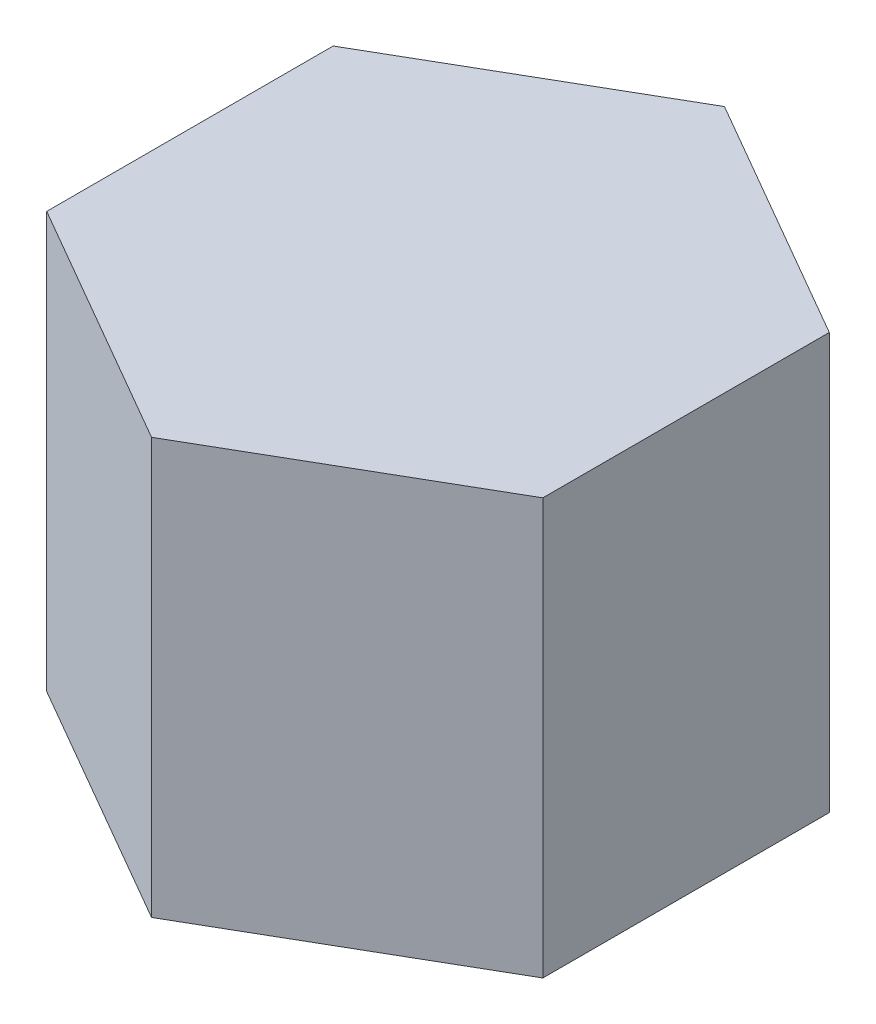
ISO-10303-21;
HEADER;
FILE_DESCRIPTION(('STEP AP214'),'2;1');
FILE_NAME('part.step','',(''),(''),'','','');
FILE_SCHEMA(('AUTOMOTIVE_DESIGN { 1 0 10303 214 1 1 1 1 }'));
ENDSEC;
DATA;
#1=APPLICATION_CONTEXT('core data for automotive mechanical design processes');
#2=APPLICATION_PROTOCOL_DEFINITION('international standard','automotive_design',2000,#1);
#3=PRODUCT_CONTEXT('',#1,'mechanical');
#4=PRODUCT('Part','Part','',(#3));
#5=PRODUCT_RELATED_PRODUCT_CATEGORY('part','',(#4));
#6=PRODUCT_DEFINITION_FORMATION('','',#4);
#7=PRODUCT_DEFINITION_CONTEXT('part definition',#1,'design');
#8=PRODUCT_DEFINITION('design','',#6,#7);
#9=PRODUCT_DEFINITION_SHAPE('','',#8);
#10=(LENGTH_UNIT() NAMED_UNIT(*) SI_UNIT(.MILLI.,.METRE.));
#11=(NAMED_UNIT(*) PLANE_ANGLE_UNIT() SI_UNIT($,.RADIAN.));
#12=(NAMED_UNIT(*) SI_UNIT($,.STERADIAN.) SOLID_ANGLE_UNIT());
#13=UNCERTAINTY_MEASURE_WITH_UNIT(LENGTH_MEASURE(1.E-05),#10,'distance_accuracy_value','');
#14=(GEOMETRIC_REPRESENTATION_CONTEXT(3) GLOBAL_UNCERTAINTY_ASSIGNED_CONTEXT((#13)) GLOBAL_UNIT_ASSIGNED_CONTEXT((#10,
#11,#12)) REPRESENTATION_CONTEXT('',''));
#15=CARTESIAN_POINT('',(0.,0.,0.));
#16=DIRECTION('',(0.,0.,1.));
#17=DIRECTION('',(1.,0.,0.));
#18=AXIS2_PLACEMENT_3D('',#15,#16,#17);
#19=CARTESIAN_POINT('',(206.142660308706,-148.537700895744,290.64094581671));
#20=DIRECTION('',(-0.499999999999909,0.,-0.866025403784491));
#21=DIRECTION('',(-0.866025403784491,0.,0.499999999999909));
#22=AXIS2_PLACEMENT_3D('',#19,#20,#21);
#23=PLANE('',#22);
#24=CARTESIAN_POINT('',(205.839551417382,-149.045793579175,290.81594581671));
#25=DIRECTION('',(0.866025403784491,0.,-0.499999999999909));
#26=VECTOR('',#25,1.);
#27=LINE('',#24,#26);
#28=CARTESIAN_POINT('',(205.839551417382,-149.045793579175,290.81594581671));
#29=VERTEX_POINT('',#28);
#30=CARTESIAN_POINT('',(206.142660308706,-149.045793579175,290.64094581671));
#31=VERTEX_POINT('',#30);
#32=EDGE_CURVE('E170',#29,#31,#27,.T.);
#33=ORIENTED_EDGE('',*,*,#32,.T.);
#34=CARTESIAN_POINT('',(206.142660308706,-148.537700895744,290.64094581671));
#35=DIRECTION('',(0.,-1.,0.));
#36=VECTOR('',#35,1.);
#37=LINE('',#34,#36);
#38=CARTESIAN_POINT('',(206.142660308706,-148.537700895744,290.64094581671));
#39=VERTEX_POINT('',#38);
#40=EDGE_CURVE('E35',#39,#31,#37,.T.);
#41=ORIENTED_EDGE('',*,*,#40,.F.);
#42=CARTESIAN_POINT('',(205.839551417382,-148.537700895744,290.81594581671));
#43=DIRECTION('',(0.866025403784491,0.,-0.499999999999909));
#44=VECTOR('',#43,1.);
#45=LINE('',#42,#44);
#46=CARTESIAN_POINT('',(205.839551417382,-148.537700895744,290.81594581671));
#47=VERTEX_POINT('',#46);
#48=EDGE_CURVE('E159',#47,#39,#45,.T.);
#49=ORIENTED_EDGE('',*,*,#48,.F.);
#50=CARTESIAN_POINT('',(205.839551417382,-148.537700895744,290.81594581671));
#51=DIRECTION('',(0.,-1.,0.));
#52=VECTOR('',#51,1.);
#53=LINE('',#50,#52);
#54=EDGE_CURVE('E10',#47,#29,#53,.T.);
#55=ORIENTED_EDGE('',*,*,#54,.T.);
#56=EDGE_LOOP('',(#33,#41,#49,#55));
#57=FACE_BOUND('',#56,.T.);
#58=ADVANCED_FACE('F16',(#57),#23,.F.);
#59=CARTESIAN_POINT('',(205.839551417382,-148.537700895744,290.81594581671));
#60=DIRECTION('',(0.500000000000062,0.,-0.866025403784403));
#61=DIRECTION('',(-0.866025403784403,0.,-0.500000000000062));
#62=AXIS2_PLACEMENT_3D('',#59,#60,#61);
#63=PLANE('',#62);
#64=CARTESIAN_POINT('',(205.536442526057,-149.045793579175,290.64094581671));
#65=DIRECTION('',(0.866025403784403,0.,0.500000000000062));
#66=VECTOR('',#65,1.);
#67=LINE('',#64,#66);
#68=CARTESIAN_POINT('',(205.536442526057,-149.045793579175,290.64094581671));
#69=VERTEX_POINT('',#68);
#70=EDGE_CURVE('E167',#69,#29,#67,.T.);
#71=ORIENTED_EDGE('',*,*,#70,.T.);
#72=ORIENTED_EDGE('',*,*,#54,.F.);
#73=CARTESIAN_POINT('',(205.536442526057,-148.537700895744,290.64094581671));
#74=DIRECTION('',(0.866025403784403,0.,0.500000000000062));
#75=VECTOR('',#74,1.);
#76=LINE('',#73,#75);
#77=CARTESIAN_POINT('',(205.536442526057,-148.537700895744,290.64094581671));
#78=VERTEX_POINT('',#77);
#79=EDGE_CURVE('E156',#78,#47,#76,.T.);
#80=ORIENTED_EDGE('',*,*,#79,.F.);
#81=CARTESIAN_POINT('',(205.536442526057,-148.537700895744,290.64094581671));
#82=DIRECTION('',(0.,-1.,0.));
#83=VECTOR('',#82,1.);
#84=LINE('',#81,#83);
#85=EDGE_CURVE('E27',#78,#69,#84,.T.);
#86=ORIENTED_EDGE('',*,*,#85,.T.);
#87=EDGE_LOOP('',(#71,#72,#80,#86));
#88=FACE_BOUND('',#87,.T.);
#89=ADVANCED_FACE('F189',(#88),#63,.F.);
#90=CARTESIAN_POINT('',(205.536442526057,-148.537700895744,290.831971220494));
#91=DIRECTION('',(1.,0.,0.));
#92=DIRECTION('',(0.,1.,0.));
#93=AXIS2_PLACEMENT_3D('',#90,#91,#92);
#94=PLANE('',#93);
#95=CARTESIAN_POINT('',(205.536442526057,-149.045793579175,290.29094581671));
#96=DIRECTION('',(0.,0.,1.));
#97=VECTOR('',#96,1.);
#98=LINE('',#95,#97);
#99=CARTESIAN_POINT('',(205.536442526057,-149.045793579175,290.29094581671));
#100=VERTEX_POINT('',#99);
#101=EDGE_CURVE('E163',#100,#69,#98,.T.);
#102=ORIENTED_EDGE('',*,*,#101,.T.);
#103=ORIENTED_EDGE('',*,*,#85,.F.);
#104=CARTESIAN_POINT('',(205.536442526057,-148.537700895744,290.29094581671));
#105=DIRECTION('',(0.,0.,1.));
#106=VECTOR('',#105,1.);
#107=LINE('',#104,#106);
#108=CARTESIAN_POINT('',(205.536442526057,-148.537700895744,290.29094581671));
#109=VERTEX_POINT('',#108);
#110=EDGE_CURVE('E106',#109,#78,#107,.T.);
#111=ORIENTED_EDGE('',*,*,#110,.F.);
#112=CARTESIAN_POINT('',(205.536442526057,-148.537700895744,290.29094581671));
#113=DIRECTION('',(0.,-1.,0.));
#114=VECTOR('',#113,1.);
#115=LINE('',#112,#114);
#116=EDGE_CURVE('E94',#109,#100,#115,.T.);
#117=ORIENTED_EDGE('',*,*,#116,.T.);
#118=EDGE_LOOP('',(#102,#103,#111,#117));
#119=FACE_BOUND('',#118,.T.);
#120=ADVANCED_FACE('F198',(#119),#94,.F.);
#121=CARTESIAN_POINT('',(205.536442526057,-148.537700895744,290.29094581671));
#122=DIRECTION('',(0.499999999999943,0.,0.866025403784472));
#123=DIRECTION('',(0.866025403784472,0.,-0.499999999999943));
#124=AXIS2_PLACEMENT_3D('',#121,#122,#123);
#125=PLANE('',#124);
#126=CARTESIAN_POINT('',(205.839551417382,-149.045793579175,290.11594581671));
#127=DIRECTION('',(-0.866025403784471,0.,0.499999999999943));
#128=VECTOR('',#127,1.);
#129=LINE('',#126,#128);
#130=CARTESIAN_POINT('',(205.839551417382,-149.045793579175,290.11594581671));
#131=VERTEX_POINT('',#130);
#132=EDGE_CURVE('E162',#131,#100,#129,.T.);
#133=ORIENTED_EDGE('',*,*,#132,.T.);
#134=ORIENTED_EDGE('',*,*,#116,.F.);
#135=CARTESIAN_POINT('',(205.839551417382,-148.537700895744,290.11594581671));
#136=DIRECTION('',(-0.866025403784471,0.,0.499999999999943));
#137=VECTOR('',#136,1.);
#138=LINE('',#135,#137);
#139=CARTESIAN_POINT('',(205.839551417382,-148.537700895744,290.11594581671));
#140=VERTEX_POINT('',#139);
#141=EDGE_CURVE('E98',#140,#109,#138,.T.);
#142=ORIENTED_EDGE('',*,*,#141,.F.);
#143=CARTESIAN_POINT('',(205.839551417382,-148.537700895744,290.11594581671));
#144=DIRECTION('',(0.,-1.,0.));
#145=VECTOR('',#144,1.);
#146=LINE('',#143,#145);
#147=EDGE_CURVE('E79',#140,#131,#146,.T.);
#148=ORIENTED_EDGE('',*,*,#147,.T.);
#149=EDGE_LOOP('',(#133,#134,#142,#148));
#150=FACE_BOUND('',#149,.T.);
#151=ADVANCED_FACE('F100',(#150),#125,.F.);
#152=CARTESIAN_POINT('',(205.839551417382,-148.537700895744,290.11594581671));
#153=DIRECTION('',(-0.500000000000062,0.,0.866025403784403));
#154=DIRECTION('',(0.866025403784403,0.,0.500000000000062));
#155=AXIS2_PLACEMENT_3D('',#152,#153,#154);
#156=PLANE('',#155);
#157=CARTESIAN_POINT('',(206.142660308706,-149.045793579175,290.29094581671));
#158=DIRECTION('',(-0.866025403784403,0.,-0.500000000000062));
#159=VECTOR('',#158,1.);
#160=LINE('',#157,#159);
#161=CARTESIAN_POINT('',(206.142660308706,-149.045793579175,290.29094581671));
#162=VERTEX_POINT('',#161);
#163=EDGE_CURVE('E88',#162,#131,#160,.T.);
#164=ORIENTED_EDGE('',*,*,#163,.T.);
#165=ORIENTED_EDGE('',*,*,#147,.F.);
#166=CARTESIAN_POINT('',(206.142660308706,-148.537700895744,290.29094581671));
#167=DIRECTION('',(-0.866025403784403,0.,-0.500000000000062));
#168=VECTOR('',#167,1.);
#169=LINE('',#166,#168);
#170=CARTESIAN_POINT('',(206.142660308706,-148.537700895744,290.29094581671));
#171=VERTEX_POINT('',#170);
#172=EDGE_CURVE('E84',#171,#140,#169,.T.);
#173=ORIENTED_EDGE('',*,*,#172,.F.);
#174=CARTESIAN_POINT('',(206.142660308706,-148.537700895744,290.29094581671));
#175=DIRECTION('',(0.,-1.,0.));
#176=VECTOR('',#175,1.);
#177=LINE('',#174,#176);
#178=EDGE_CURVE('E58',#171,#162,#177,.T.);
#179=ORIENTED_EDGE('',*,*,#178,.T.);
#180=EDGE_LOOP('',(#164,#165,#173,#179));
#181=FACE_BOUND('',#180,.T.);
#182=ADVANCED_FACE('F82',(#181),#156,.F.);
#183=CARTESIAN_POINT('',(206.142660308706,-148.537700895744,290.831971220494));
#184=DIRECTION('',(-1.,0.,0.));
#185=DIRECTION('',(0.,-1.,0.));
#186=AXIS2_PLACEMENT_3D('',#183,#184,#185);
#187=PLANE('',#186);
#188=CARTESIAN_POINT('',(206.142660308706,-149.045793579175,290.64094581671));
#189=DIRECTION('',(0.,0.,-1.));
#190=VECTOR('',#189,1.);
#191=LINE('',#188,#190);
#192=EDGE_CURVE('E160',#31,#162,#191,.T.);
#193=ORIENTED_EDGE('',*,*,#192,.T.);
#194=ORIENTED_EDGE('',*,*,#178,.F.);
#195=CARTESIAN_POINT('',(206.142660308706,-148.537700895744,290.64094581671));
#196=DIRECTION('',(0.,0.,-1.));
#197=VECTOR('',#196,1.);
#198=LINE('',#195,#197);
#199=EDGE_CURVE('E112',#39,#171,#198,.T.);
#200=ORIENTED_EDGE('',*,*,#199,.F.);
#201=ORIENTED_EDGE('',*,*,#40,.T.);
#202=EDGE_LOOP('',(#193,#194,#200,#201));
#203=FACE_BOUND('',#202,.T.);
#204=ADVANCED_FACE('F131',(#203),#187,.F.);
#205=CARTESIAN_POINT('',(206.339551417382,-148.537700895744,290.831971220494));
#206=DIRECTION('',(0.,-1.,0.));
#207=DIRECTION('',(1.,0.,0.));
#208=AXIS2_PLACEMENT_3D('',#205,#206,#207);
#209=PLANE('',#208);
#210=ORIENTED_EDGE('',*,*,#48,.T.);
#211=ORIENTED_EDGE('',*,*,#199,.T.);
#212=ORIENTED_EDGE('',*,*,#172,.T.);
#213=ORIENTED_EDGE('',*,*,#141,.T.);
#214=ORIENTED_EDGE('',*,*,#110,.T.);
#215=ORIENTED_EDGE('',*,*,#79,.T.);
#216=EDGE_LOOP('',(#210,#211,#212,#213,#214,#215));
#217=FACE_BOUND('',#216,.T.);
#218=ADVANCED_FACE('F111',(#217),#209,.F.);
#219=CARTESIAN_POINT('',(206.339551417382,-149.045793579175,290.831971220494));
#220=DIRECTION('',(0.,-1.,0.));
#221=DIRECTION('',(1.,0.,0.));
#222=AXIS2_PLACEMENT_3D('',#219,#220,#221);
#223=PLANE('',#222);
#224=ORIENTED_EDGE('',*,*,#32,.F.);
#225=ORIENTED_EDGE('',*,*,#70,.F.);
#226=ORIENTED_EDGE('',*,*,#101,.F.);
#227=ORIENTED_EDGE('',*,*,#132,.F.);
#228=ORIENTED_EDGE('',*,*,#163,.F.);
#229=ORIENTED_EDGE('',*,*,#192,.F.);
#230=EDGE_LOOP('',(#224,#225,#226,#227,#228,#229));
#231=FACE_BOUND('',#230,.T.);
#232=ADVANCED_FACE('F130',(#231),#223,.T.);
#233=CLOSED_SHELL('',(#58,#89,#120,#151,#182,#204,#218,#232));
#234=MANIFOLD_SOLID_BREP('B1',#233);
#235=ADVANCED_BREP_SHAPE_REPRESENTATION('',(#18,#234),#14);
#236=SHAPE_DEFINITION_REPRESENTATION(#9,#235);
ENDSEC;
END-ISO-10303-21;
